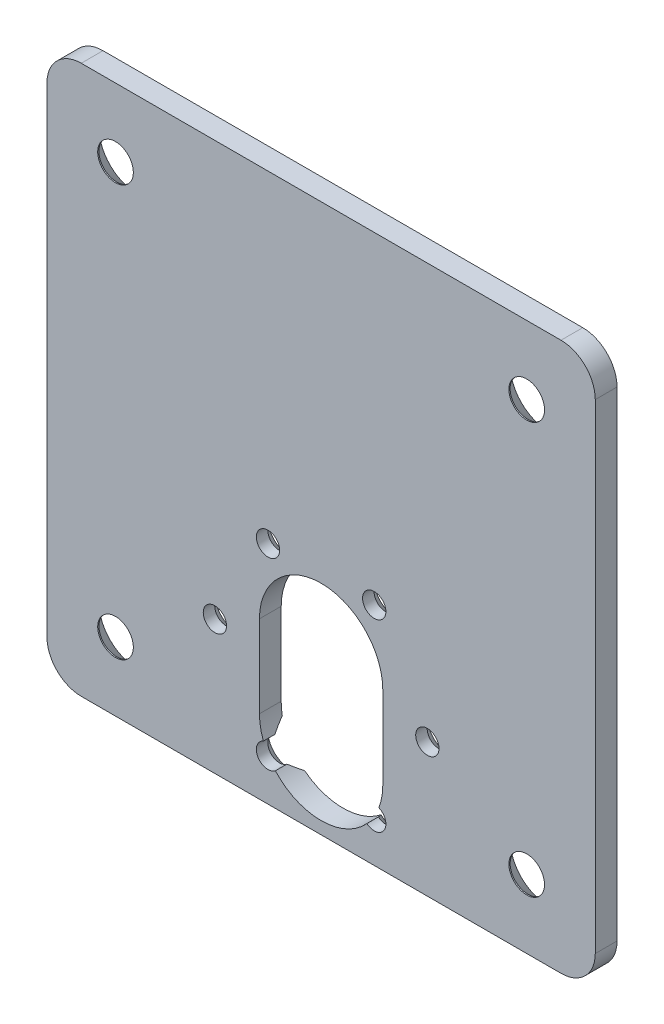
ISO-10303-21;
HEADER;
FILE_DESCRIPTION(('STEP AP214'),'2;1');
FILE_NAME('part.step','',(''),(''),'','','');
FILE_SCHEMA(('AUTOMOTIVE_DESIGN { 1 0 10303 214 1 1 1 1 }'));
ENDSEC;
DATA;
#1=APPLICATION_CONTEXT('core data for automotive mechanical design processes');
#2=APPLICATION_PROTOCOL_DEFINITION('international standard','automotive_design',2000,#1);
#3=PRODUCT_CONTEXT('',#1,'mechanical');
#4=PRODUCT('Part','Part','',(#3));
#5=PRODUCT_RELATED_PRODUCT_CATEGORY('part','',(#4));
#6=PRODUCT_DEFINITION_FORMATION('','',#4);
#7=PRODUCT_DEFINITION_CONTEXT('part definition',#1,'design');
#8=PRODUCT_DEFINITION('design','',#6,#7);
#9=PRODUCT_DEFINITION_SHAPE('','',#8);
#10=(LENGTH_UNIT() NAMED_UNIT(*) SI_UNIT(.MILLI.,.METRE.));
#11=(NAMED_UNIT(*) PLANE_ANGLE_UNIT() SI_UNIT($,.RADIAN.));
#12=(NAMED_UNIT(*) SI_UNIT($,.STERADIAN.) SOLID_ANGLE_UNIT());
#13=UNCERTAINTY_MEASURE_WITH_UNIT(LENGTH_MEASURE(1.E-05),#10,'distance_accuracy_value','');
#14=(GEOMETRIC_REPRESENTATION_CONTEXT(3) GLOBAL_UNCERTAINTY_ASSIGNED_CONTEXT((#13)) GLOBAL_UNIT_ASSIGNED_CONTEXT((#10,
#11,#12)) REPRESENTATION_CONTEXT('',''));
#15=CARTESIAN_POINT('',(0.,0.,0.));
#16=DIRECTION('',(0.,0.,1.));
#17=DIRECTION('',(1.,0.,0.));
#18=AXIS2_PLACEMENT_3D('',#15,#16,#17);
#19=CARTESIAN_POINT('',(-35.,-35.,3.175));
#20=DIRECTION('',(0.,0.,1.));
#21=DIRECTION('',(1.,0.,0.));
#22=AXIS2_PLACEMENT_3D('',#19,#20,#21);
#23=PLANE('',#22);
#24=CARTESIAN_POINT('',(-7.74999999999989,-7.0766062413412,3.175));
#25=DIRECTION('',(0.,0.,-1.));
#26=DIRECTION('',(-1.,0.,0.));
#27=AXIS2_PLACEMENT_3D('',#24,#25,#26);
#28=CIRCLE('',#27,1.7);
#29=CARTESIAN_POINT('',(-9.44999999999989,-7.0766062413412,3.175));
#30=VERTEX_POINT('',#29);
#31=EDGE_CURVE('E200',#30,#30,#28,.T.);
#32=ORIENTED_EDGE('',*,*,#31,.T.);
#33=EDGE_LOOP('',(#32));
#34=FACE_BOUND('',#33,.T.);
#35=CARTESIAN_POINT('',(-2.45029690981724E-11,-29.2025599760143,3.175));
#36=DIRECTION('',(0.,0.,-1.));
#37=DIRECTION('',(-1.,0.,0.));
#38=AXIS2_PLACEMENT_3D('',#35,#36,#37);
#39=CIRCLE('',#38,9.);
#40=CARTESIAN_POINT('',(-8.42653520092069,-32.3638104418992,3.175));
#41=VERTEX_POINT('',#40);
#42=CARTESIAN_POINT('',(-9.0000000000245,-29.2025599760143,3.175));
#43=VERTEX_POINT('',#42);
#44=EDGE_CURVE('E173',#41,#43,#39,.T.);
#45=ORIENTED_EDGE('',*,*,#44,.T.);
#46=DIRECTION('',(0.,1.,0.));
#47=VECTOR('',#46,1.);
#48=CARTESIAN_POINT('',(-9.0000000000245,-17.2025599760143,3.175));
#49=LINE('',#48,#47);
#50=CARTESIAN_POINT('',(-9.0000000000245,-17.2025599760143,3.175));
#51=VERTEX_POINT('',#50);
#52=EDGE_CURVE('E185',#43,#51,#49,.T.);
#53=ORIENTED_EDGE('',*,*,#52,.T.);
#54=CARTESIAN_POINT('',(0.,-17.2025599760143,3.175));
#55=DIRECTION('',(0.,0.,-1.));
#56=DIRECTION('',(-1.,0.,0.));
#57=AXIS2_PLACEMENT_3D('',#54,#55,#56);
#58=CIRCLE('',#57,9.);
#59=CARTESIAN_POINT('',(8.9999999999755,-17.2025599760143,3.175));
#60=VERTEX_POINT('',#59);
#61=EDGE_CURVE('E189',#51,#60,#58,.T.);
#62=ORIENTED_EDGE('',*,*,#61,.T.);
#63=DIRECTION('',(0.,-1.,0.));
#64=VECTOR('',#63,1.);
#65=CARTESIAN_POINT('',(8.9999999999755,-17.2025599760143,3.175));
#66=LINE('',#65,#64);
#67=CARTESIAN_POINT('',(8.9999999999755,-29.2025599760143,3.175));
#68=VERTEX_POINT('',#67);
#69=EDGE_CURVE('E203',#60,#68,#66,.T.);
#70=ORIENTED_EDGE('',*,*,#69,.T.);
#71=CARTESIAN_POINT('',(-2.45029690981724E-11,-29.2025599760143,3.175));
#72=DIRECTION('',(0.,0.,-1.));
#73=DIRECTION('',(-1.,0.,0.));
#74=AXIS2_PLACEMENT_3D('',#71,#72,#73);
#75=CIRCLE('',#74,9.);
#76=CARTESIAN_POINT('',(8.4265352008785,-32.363810441881,3.175));
#77=VERTEX_POINT('',#76);
#78=EDGE_CURVE('E206',#68,#77,#75,.T.);
#79=ORIENTED_EDGE('',*,*,#78,.T.);
#80=CARTESIAN_POINT('',(7.74999999999987,-33.923393758659,3.175));
#81=DIRECTION('',(0.,0.,-1.));
#82=DIRECTION('',(-1.,0.,0.));
#83=AXIS2_PLACEMENT_3D('',#80,#81,#82);
#84=CIRCLE('',#83,1.7);
#85=CARTESIAN_POINT('',(6.67454591679545,-35.2399796901192,3.175));
#86=VERTEX_POINT('',#85);
#87=EDGE_CURVE('E209',#77,#86,#84,.T.);
#88=ORIENTED_EDGE('',*,*,#87,.T.);
#89=CARTESIAN_POINT('',(-2.45029690981724E-11,-29.2025599760143,3.175));
#90=DIRECTION('',(0.,0.,-1.));
#91=DIRECTION('',(-1.,0.,0.));
#92=AXIS2_PLACEMENT_3D('',#89,#90,#91);
#93=CIRCLE('',#92,9.);
#94=CARTESIAN_POINT('',(-6.67454591682371,-35.2399796901421,3.175));
#95=VERTEX_POINT('',#94);
#96=EDGE_CURVE('E212',#86,#95,#93,.T.);
#97=ORIENTED_EDGE('',*,*,#96,.T.);
#98=CARTESIAN_POINT('',(-7.74999999999998,-33.9233937586589,3.175));
#99=DIRECTION('',(0.,0.,-1.));
#100=DIRECTION('',(-1.,0.,0.));
#101=AXIS2_PLACEMENT_3D('',#98,#99,#100);
#102=CIRCLE('',#101,1.7);
#103=EDGE_CURVE('E181',#95,#41,#102,.T.);
#104=ORIENTED_EDGE('',*,*,#103,.T.);
#105=EDGE_LOOP('',(#45,#53,#62,#70,#79,#88,#97,#104));
#106=FACE_BOUND('',#105,.T.);
#107=CARTESIAN_POINT('',(-15.5,-20.5000000000001,3.175));
#108=DIRECTION('',(0.,0.,-1.));
#109=DIRECTION('',(-1.,0.,0.));
#110=AXIS2_PLACEMENT_3D('',#107,#108,#109);
#111=CIRCLE('',#110,1.69999999999999);
#112=CARTESIAN_POINT('',(-17.2,-20.5000000000001,3.175));
#113=VERTEX_POINT('',#112);
#114=EDGE_CURVE('E228',#113,#113,#111,.T.);
#115=ORIENTED_EDGE('',*,*,#114,.T.);
#116=EDGE_LOOP('',(#115));
#117=FACE_BOUND('',#116,.T.);
#118=CARTESIAN_POINT('',(7.75000000000005,-7.0766062413413,3.175));
#119=DIRECTION('',(0.,0.,-1.));
#120=DIRECTION('',(-1.,0.,0.));
#121=AXIS2_PLACEMENT_3D('',#118,#119,#120);
#122=CIRCLE('',#121,1.7);
#123=CARTESIAN_POINT('',(6.05000000000005,-7.0766062413413,3.175));
#124=VERTEX_POINT('',#123);
#125=EDGE_CURVE('E245',#124,#124,#122,.T.);
#126=ORIENTED_EDGE('',*,*,#125,.T.);
#127=EDGE_LOOP('',(#126));
#128=FACE_BOUND('',#127,.T.);
#129=CARTESIAN_POINT('',(15.5,-20.5000000000002,3.175));
#130=DIRECTION('',(0.,0.,-1.));
#131=DIRECTION('',(-1.,0.,0.));
#132=AXIS2_PLACEMENT_3D('',#129,#130,#131);
#133=CIRCLE('',#132,1.7);
#134=CARTESIAN_POINT('',(13.8,-20.5000000000002,3.175));
#135=VERTEX_POINT('',#134);
#136=EDGE_CURVE('E248',#135,#135,#133,.T.);
#137=ORIENTED_EDGE('',*,*,#136,.T.);
#138=EDGE_LOOP('',(#137));
#139=FACE_BOUND('',#138,.T.);
#140=CARTESIAN_POINT('',(30.,-30.,3.175));
#141=DIRECTION('',(0.,0.,1.));
#142=DIRECTION('',(1.,0.,0.));
#143=AXIS2_PLACEMENT_3D('',#140,#141,#142);
#144=CIRCLE('',#143,2.59999999999999);
#145=CARTESIAN_POINT('',(32.6,-30.,3.175));
#146=VERTEX_POINT('',#145);
#147=EDGE_CURVE('E254',#146,#146,#144,.T.);
#148=ORIENTED_EDGE('',*,*,#147,.F.);
#149=EDGE_LOOP('',(#148));
#150=FACE_BOUND('',#149,.T.);
#151=CARTESIAN_POINT('',(-30.,30.,3.175));
#152=DIRECTION('',(0.,0.,1.));
#153=DIRECTION('',(1.,0.,0.));
#154=AXIS2_PLACEMENT_3D('',#151,#152,#153);
#155=CIRCLE('',#154,2.6);
#156=CARTESIAN_POINT('',(-27.4,30.,3.175));
#157=VERTEX_POINT('',#156);
#158=EDGE_CURVE('E260',#157,#157,#155,.T.);
#159=ORIENTED_EDGE('',*,*,#158,.F.);
#160=EDGE_LOOP('',(#159));
#161=FACE_BOUND('',#160,.T.);
#162=CARTESIAN_POINT('',(-35.,-35.,3.175));
#163=DIRECTION('',(0.,0.,1.));
#164=DIRECTION('',(1.,0.,0.));
#165=AXIS2_PLACEMENT_3D('',#162,#163,#164);
#166=CIRCLE('',#165,5.00000000000001);
#167=CARTESIAN_POINT('',(-40.,-35.,3.175));
#168=VERTEX_POINT('',#167);
#169=CARTESIAN_POINT('',(-35.,-40.,3.175));
#170=VERTEX_POINT('',#169);
#171=EDGE_CURVE('E264',#168,#170,#166,.T.);
#172=ORIENTED_EDGE('',*,*,#171,.T.);
#173=DIRECTION('',(1.,0.,0.));
#174=VECTOR('',#173,1.);
#175=CARTESIAN_POINT('',(35.,-40.,3.175));
#176=LINE('',#175,#174);
#177=CARTESIAN_POINT('',(35.,-40.,3.175));
#178=VERTEX_POINT('',#177);
#179=EDGE_CURVE('E267',#170,#178,#176,.T.);
#180=ORIENTED_EDGE('',*,*,#179,.T.);
#181=CARTESIAN_POINT('',(35.,-35.,3.175));
#182=DIRECTION('',(0.,0.,1.));
#183=DIRECTION('',(1.,0.,0.));
#184=AXIS2_PLACEMENT_3D('',#181,#182,#183);
#185=CIRCLE('',#184,4.99999999999999);
#186=CARTESIAN_POINT('',(40.,-35.,3.175));
#187=VERTEX_POINT('',#186);
#188=EDGE_CURVE('E271',#178,#187,#185,.T.);
#189=ORIENTED_EDGE('',*,*,#188,.T.);
#190=DIRECTION('',(0.,1.,0.));
#191=VECTOR('',#190,1.);
#192=CARTESIAN_POINT('',(40.,-35.,3.175));
#193=LINE('',#192,#191);
#194=CARTESIAN_POINT('',(40.,35.,3.175));
#195=VERTEX_POINT('',#194);
#196=EDGE_CURVE('E273',#187,#195,#193,.T.);
#197=ORIENTED_EDGE('',*,*,#196,.T.);
#198=CARTESIAN_POINT('',(35.,35.,3.175));
#199=DIRECTION('',(0.,0.,1.));
#200=DIRECTION('',(1.,0.,0.));
#201=AXIS2_PLACEMENT_3D('',#198,#199,#200);
#202=CIRCLE('',#201,5.);
#203=CARTESIAN_POINT('',(35.,40.,3.175));
#204=VERTEX_POINT('',#203);
#205=EDGE_CURVE('E275',#195,#204,#202,.T.);
#206=ORIENTED_EDGE('',*,*,#205,.T.);
#207=DIRECTION('',(-1.,0.,0.));
#208=VECTOR('',#207,1.);
#209=CARTESIAN_POINT('',(35.,40.,3.175));
#210=LINE('',#209,#208);
#211=CARTESIAN_POINT('',(-35.,40.,3.175));
#212=VERTEX_POINT('',#211);
#213=EDGE_CURVE('E277',#204,#212,#210,.T.);
#214=ORIENTED_EDGE('',*,*,#213,.T.);
#215=CARTESIAN_POINT('',(-35.,35.,3.175));
#216=DIRECTION('',(0.,0.,1.));
#217=DIRECTION('',(1.,0.,0.));
#218=AXIS2_PLACEMENT_3D('',#215,#216,#217);
#219=CIRCLE('',#218,5.);
#220=CARTESIAN_POINT('',(-40.,35.,3.175));
#221=VERTEX_POINT('',#220);
#222=EDGE_CURVE('E279',#212,#221,#219,.T.);
#223=ORIENTED_EDGE('',*,*,#222,.T.);
#224=DIRECTION('',(0.,-1.,0.));
#225=VECTOR('',#224,1.);
#226=CARTESIAN_POINT('',(-40.,-35.,3.175));
#227=LINE('',#226,#225);
#228=EDGE_CURVE('E281',#221,#168,#227,.T.);
#229=ORIENTED_EDGE('',*,*,#228,.T.);
#230=EDGE_LOOP('',(#172,#180,#189,#197,#206,#214,#223,#229));
#231=FACE_BOUND('',#230,.T.);
#232=CARTESIAN_POINT('',(30.,30.,3.175));
#233=DIRECTION('',(0.,0.,1.));
#234=DIRECTION('',(-1.,0.,0.));
#235=AXIS2_PLACEMENT_3D('',#232,#233,#234);
#236=CIRCLE('',#235,2.59999999999999);
#237=CARTESIAN_POINT('',(27.4,30.,3.175));
#238=VERTEX_POINT('',#237);
#239=EDGE_CURVE('E257',#238,#238,#236,.T.);
#240=ORIENTED_EDGE('',*,*,#239,.F.);
#241=EDGE_LOOP('',(#240));
#242=FACE_BOUND('',#241,.T.);
#243=CARTESIAN_POINT('',(-30.,-30.,3.175));
#244=DIRECTION('',(0.,0.,1.));
#245=DIRECTION('',(-1.,0.,0.));
#246=AXIS2_PLACEMENT_3D('',#243,#244,#245);
#247=CIRCLE('',#246,2.6);
#248=CARTESIAN_POINT('',(-32.6,-30.,3.175));
#249=VERTEX_POINT('',#248);
#250=EDGE_CURVE('E251',#249,#249,#247,.T.);
#251=ORIENTED_EDGE('',*,*,#250,.F.);
#252=EDGE_LOOP('',(#251));
#253=FACE_BOUND('',#252,.T.);
#254=ADVANCED_FACE('F39',(#34,#106,#117,#128,#139,#150,#161,#231,#242,#253),#23,.T.);
#255=CARTESIAN_POINT('',(-35.,-35.,0.));
#256=DIRECTION('',(0.,0.,1.));
#257=DIRECTION('',(1.,0.,0.));
#258=AXIS2_PLACEMENT_3D('',#255,#256,#257);
#259=PLANE('',#258);
#260=CARTESIAN_POINT('',(-7.74999999999989,-7.0766062413412,0.));
#261=DIRECTION('',(0.,0.,1.));
#262=DIRECTION('',(1.,0.,0.));
#263=AXIS2_PLACEMENT_3D('',#260,#261,#262);
#264=CIRCLE('',#263,3.19999999999999);
#265=CARTESIAN_POINT('',(-4.5499999999999,-7.0766062413412,0.));
#266=VERTEX_POINT('',#265);
#267=EDGE_CURVE('E364',#266,#266,#264,.T.);
#268=ORIENTED_EDGE('',*,*,#267,.T.);
#269=EDGE_LOOP('',(#268));
#270=FACE_BOUND('',#269,.T.);
#271=CARTESIAN_POINT('',(7.75000000000005,-7.0766062413413,0.));
#272=DIRECTION('',(0.,0.,1.));
#273=DIRECTION('',(1.,0.,0.));
#274=AXIS2_PLACEMENT_3D('',#271,#272,#273);
#275=CIRCLE('',#274,3.19999999999999);
#276=CARTESIAN_POINT('',(10.95,-7.0766062413413,0.));
#277=VERTEX_POINT('',#276);
#278=EDGE_CURVE('E361',#277,#277,#275,.T.);
#279=ORIENTED_EDGE('',*,*,#278,.T.);
#280=EDGE_LOOP('',(#279));
#281=FACE_BOUND('',#280,.T.);
#282=CARTESIAN_POINT('',(-15.5,-20.5000000000001,0.));
#283=DIRECTION('',(0.,0.,1.));
#284=DIRECTION('',(1.,0.,0.));
#285=AXIS2_PLACEMENT_3D('',#282,#283,#284);
#286=CIRCLE('',#285,3.19999999999998);
#287=CARTESIAN_POINT('',(-12.3,-20.5000000000001,0.));
#288=VERTEX_POINT('',#287);
#289=EDGE_CURVE('E353',#288,#288,#286,.T.);
#290=ORIENTED_EDGE('',*,*,#289,.T.);
#291=EDGE_LOOP('',(#290));
#292=FACE_BOUND('',#291,.T.);
#293=CARTESIAN_POINT('',(15.5,-20.5000000000002,0.));
#294=DIRECTION('',(0.,0.,1.));
#295=DIRECTION('',(1.,0.,0.));
#296=AXIS2_PLACEMENT_3D('',#293,#294,#295);
#297=CIRCLE('',#296,3.2);
#298=CARTESIAN_POINT('',(18.7,-20.5000000000002,0.));
#299=VERTEX_POINT('',#298);
#300=EDGE_CURVE('E350',#299,#299,#297,.T.);
#301=ORIENTED_EDGE('',*,*,#300,.T.);
#302=EDGE_LOOP('',(#301));
#303=FACE_BOUND('',#302,.T.);
#304=CARTESIAN_POINT('',(-2.45029690981724E-11,-29.2025599760143,0.));
#305=DIRECTION('',(0.,0.,-1.));
#306=DIRECTION('',(-1.,0.,0.));
#307=AXIS2_PLACEMENT_3D('',#304,#305,#306);
#308=CIRCLE('',#307,9.);
#309=CARTESIAN_POINT('',(5.57344120167671,-36.2691541465592,0.));
#310=VERTEX_POINT('',#309);
#311=CARTESIAN_POINT('',(-5.57344120169929,-36.26915414658,0.));
#312=VERTEX_POINT('',#311);
#313=EDGE_CURVE('E194',#310,#312,#308,.T.);
#314=ORIENTED_EDGE('',*,*,#313,.F.);
#315=CARTESIAN_POINT('',(7.74999999999987,-33.923393758659,0.));
#316=DIRECTION('',(0.,0.,1.));
#317=DIRECTION('',(1.,0.,0.));
#318=AXIS2_PLACEMENT_3D('',#315,#316,#317);
#319=CIRCLE('',#318,3.19999999999999);
#320=CARTESIAN_POINT('',(8.83591739371989,-30.9132802368767,0.));
#321=VERTEX_POINT('',#320);
#322=EDGE_CURVE('E358',#310,#321,#319,.T.);
#323=ORIENTED_EDGE('',*,*,#322,.T.);
#324=CARTESIAN_POINT('',(-2.45029690981724E-11,-29.2025599760143,0.));
#325=DIRECTION('',(0.,0.,-1.));
#326=DIRECTION('',(-1.,0.,0.));
#327=AXIS2_PLACEMENT_3D('',#324,#325,#326);
#328=CIRCLE('',#327,9.);
#329=CARTESIAN_POINT('',(8.9999999999755,-29.2025599760143,0.));
#330=VERTEX_POINT('',#329);
#331=EDGE_CURVE('E197',#330,#321,#328,.T.);
#332=ORIENTED_EDGE('',*,*,#331,.F.);
#333=DIRECTION('',(0.,-1.,0.));
#334=VECTOR('',#333,1.);
#335=CARTESIAN_POINT('',(8.9999999999755,-17.2025599760143,0.));
#336=LINE('',#335,#334);
#337=CARTESIAN_POINT('',(8.9999999999755,-17.2025599760143,0.));
#338=VERTEX_POINT('',#337);
#339=EDGE_CURVE('E221',#338,#330,#336,.T.);
#340=ORIENTED_EDGE('',*,*,#339,.F.);
#341=CARTESIAN_POINT('',(0.,-17.2025599760143,0.));
#342=DIRECTION('',(0.,0.,-1.));
#343=DIRECTION('',(-1.,0.,0.));
#344=AXIS2_PLACEMENT_3D('',#341,#342,#343);
#345=CIRCLE('',#344,9.);
#346=CARTESIAN_POINT('',(-8.99999999999999,-17.2025599760143,0.));
#347=VERTEX_POINT('',#346);
#348=EDGE_CURVE('E218',#347,#338,#345,.T.);
#349=ORIENTED_EDGE('',*,*,#348,.F.);
#350=DIRECTION('',(0.,1.,0.));
#351=VECTOR('',#350,1.);
#352=CARTESIAN_POINT('',(-9.0000000000245,-17.2025599760143,0.));
#353=LINE('',#352,#351);
#354=CARTESIAN_POINT('',(-9.0000000000245,-29.2025599760143,0.));
#355=VERTEX_POINT('',#354);
#356=EDGE_CURVE('E216',#355,#347,#353,.T.);
#357=ORIENTED_EDGE('',*,*,#356,.F.);
#358=CARTESIAN_POINT('',(-2.45029690981724E-11,-29.2025599760143,0.));
#359=DIRECTION('',(0.,0.,-1.));
#360=DIRECTION('',(-1.,0.,0.));
#361=AXIS2_PLACEMENT_3D('',#358,#359,#360);
#362=CIRCLE('',#361,9.);
#363=CARTESIAN_POINT('',(-8.83591739376573,-30.9132802368931,0.));
#364=VERTEX_POINT('',#363);
#365=EDGE_CURVE('E176',#364,#355,#362,.T.);
#366=ORIENTED_EDGE('',*,*,#365,.F.);
#367=CARTESIAN_POINT('',(-7.74999999999998,-33.9233937586589,0.));
#368=DIRECTION('',(0.,0.,1.));
#369=DIRECTION('',(1.,0.,0.));
#370=AXIS2_PLACEMENT_3D('',#367,#368,#369);
#371=CIRCLE('',#370,3.20000000000002);
#372=EDGE_CURVE('E356',#364,#312,#371,.T.);
#373=ORIENTED_EDGE('',*,*,#372,.T.);
#374=EDGE_LOOP('',(#314,#323,#332,#340,#349,#357,#366,#373));
#375=FACE_BOUND('',#374,.T.);
#376=CARTESIAN_POINT('',(30.,30.,0.));
#377=DIRECTION('',(0.,0.,1.));
#378=DIRECTION('',(1.,0.,0.));
#379=AXIS2_PLACEMENT_3D('',#376,#377,#378);
#380=CIRCLE('',#379,5.59999999999998);
#381=CARTESIAN_POINT('',(35.6,30.,0.));
#382=VERTEX_POINT('',#381);
#383=EDGE_CURVE('E332',#382,#382,#380,.T.);
#384=ORIENTED_EDGE('',*,*,#383,.T.);
#385=EDGE_LOOP('',(#384));
#386=FACE_BOUND('',#385,.T.);
#387=CARTESIAN_POINT('',(-30.,30.,0.));
#388=DIRECTION('',(0.,0.,1.));
#389=DIRECTION('',(1.,0.,0.));
#390=AXIS2_PLACEMENT_3D('',#387,#388,#389);
#391=CIRCLE('',#390,5.59999999999998);
#392=CARTESIAN_POINT('',(-24.4,30.,0.));
#393=VERTEX_POINT('',#392);
#394=EDGE_CURVE('E329',#393,#393,#391,.T.);
#395=ORIENTED_EDGE('',*,*,#394,.T.);
#396=EDGE_LOOP('',(#395));
#397=FACE_BOUND('',#396,.T.);
#398=CARTESIAN_POINT('',(30.,-30.,0.));
#399=DIRECTION('',(0.,0.,1.));
#400=DIRECTION('',(1.,0.,0.));
#401=AXIS2_PLACEMENT_3D('',#398,#399,#400);
#402=CIRCLE('',#401,5.60000000000002);
#403=CARTESIAN_POINT('',(35.6,-30.,0.));
#404=VERTEX_POINT('',#403);
#405=EDGE_CURVE('E326',#404,#404,#402,.T.);
#406=ORIENTED_EDGE('',*,*,#405,.T.);
#407=EDGE_LOOP('',(#406));
#408=FACE_BOUND('',#407,.T.);
#409=CARTESIAN_POINT('',(-30.,-30.,0.));
#410=DIRECTION('',(0.,0.,1.));
#411=DIRECTION('',(1.,0.,0.));
#412=AXIS2_PLACEMENT_3D('',#409,#410,#411);
#413=CIRCLE('',#412,5.60000000000002);
#414=CARTESIAN_POINT('',(-24.4,-30.,0.));
#415=VERTEX_POINT('',#414);
#416=EDGE_CURVE('E323',#415,#415,#413,.T.);
#417=ORIENTED_EDGE('',*,*,#416,.T.);
#418=EDGE_LOOP('',(#417));
#419=FACE_BOUND('',#418,.T.);
#420=CARTESIAN_POINT('',(-35.,-35.,0.));
#421=DIRECTION('',(0.,0.,1.));
#422=DIRECTION('',(1.,0.,0.));
#423=AXIS2_PLACEMENT_3D('',#420,#421,#422);
#424=CIRCLE('',#423,5.00000000000001);
#425=CARTESIAN_POINT('',(-40.,-35.,0.));
#426=VERTEX_POINT('',#425);
#427=CARTESIAN_POINT('',(-35.,-40.,0.));
#428=VERTEX_POINT('',#427);
#429=EDGE_CURVE('E263',#426,#428,#424,.T.);
#430=ORIENTED_EDGE('',*,*,#429,.F.);
#431=DIRECTION('',(0.,-1.,0.));
#432=VECTOR('',#431,1.);
#433=CARTESIAN_POINT('',(-40.,-35.,0.));
#434=LINE('',#433,#432);
#435=CARTESIAN_POINT('',(-40.,35.,0.));
#436=VERTEX_POINT('',#435);
#437=EDGE_CURVE('E268',#436,#426,#434,.T.);
#438=ORIENTED_EDGE('',*,*,#437,.F.);
#439=CARTESIAN_POINT('',(-35.,35.,0.));
#440=DIRECTION('',(0.,0.,1.));
#441=DIRECTION('',(1.,0.,0.));
#442=AXIS2_PLACEMENT_3D('',#439,#440,#441);
#443=CIRCLE('',#442,5.);
#444=CARTESIAN_POINT('',(-35.,40.,0.));
#445=VERTEX_POINT('',#444);
#446=EDGE_CURVE('E297',#445,#436,#443,.T.);
#447=ORIENTED_EDGE('',*,*,#446,.F.);
#448=DIRECTION('',(-1.,0.,0.));
#449=VECTOR('',#448,1.);
#450=CARTESIAN_POINT('',(35.,40.,0.));
#451=LINE('',#450,#449);
#452=CARTESIAN_POINT('',(35.,40.,0.));
#453=VERTEX_POINT('',#452);
#454=EDGE_CURVE('E295',#453,#445,#451,.T.);
#455=ORIENTED_EDGE('',*,*,#454,.F.);
#456=CARTESIAN_POINT('',(35.,35.,0.));
#457=DIRECTION('',(0.,0.,1.));
#458=DIRECTION('',(1.,0.,0.));
#459=AXIS2_PLACEMENT_3D('',#456,#457,#458);
#460=CIRCLE('',#459,5.);
#461=CARTESIAN_POINT('',(40.,35.,0.));
#462=VERTEX_POINT('',#461);
#463=EDGE_CURVE('E293',#462,#453,#460,.T.);
#464=ORIENTED_EDGE('',*,*,#463,.F.);
#465=DIRECTION('',(0.,1.,0.));
#466=VECTOR('',#465,1.);
#467=CARTESIAN_POINT('',(40.,-35.,0.));
#468=LINE('',#467,#466);
#469=CARTESIAN_POINT('',(40.,-35.,0.));
#470=VERTEX_POINT('',#469);
#471=EDGE_CURVE('E291',#470,#462,#468,.T.);
#472=ORIENTED_EDGE('',*,*,#471,.F.);
#473=CARTESIAN_POINT('',(35.,-35.,0.));
#474=DIRECTION('',(0.,0.,1.));
#475=DIRECTION('',(1.,0.,0.));
#476=AXIS2_PLACEMENT_3D('',#473,#474,#475);
#477=CIRCLE('',#476,4.99999999999999);
#478=CARTESIAN_POINT('',(35.,-40.,0.));
#479=VERTEX_POINT('',#478);
#480=EDGE_CURVE('E289',#479,#470,#477,.T.);
#481=ORIENTED_EDGE('',*,*,#480,.F.);
#482=DIRECTION('',(1.,0.,0.));
#483=VECTOR('',#482,1.);
#484=CARTESIAN_POINT('',(35.,-40.,0.));
#485=LINE('',#484,#483);
#486=EDGE_CURVE('E286',#428,#479,#485,.T.);
#487=ORIENTED_EDGE('',*,*,#486,.F.);
#488=EDGE_LOOP('',(#430,#438,#447,#455,#464,#472,#481,#487));
#489=FACE_BOUND('',#488,.T.);
#490=ADVANCED_FACE('F451',(#270,#281,#292,#303,#375,#386,#397,#408,#419,#489),#259,.F.);
#491=CARTESIAN_POINT('',(-35.,-35.,3.175));
#492=DIRECTION('',(0.,0.,-1.));
#493=DIRECTION('',(-1.,0.,0.));
#494=AXIS2_PLACEMENT_3D('',#491,#492,#493);
#495=CYLINDRICAL_SURFACE('',#494,5.00000000000001);
#496=ORIENTED_EDGE('',*,*,#429,.T.);
#497=DIRECTION('',(0.,0.,-1.));
#498=VECTOR('',#497,1.);
#499=CARTESIAN_POINT('',(-35.,-40.,3.175));
#500=LINE('',#499,#498);
#501=EDGE_CURVE('E320',#170,#428,#500,.T.);
#502=ORIENTED_EDGE('',*,*,#501,.F.);
#503=ORIENTED_EDGE('',*,*,#171,.F.);
#504=DIRECTION('',(0.,0.,-1.));
#505=VECTOR('',#504,1.);
#506=CARTESIAN_POINT('',(-40.,-35.,3.175));
#507=LINE('',#506,#505);
#508=EDGE_CURVE('E283',#168,#426,#507,.T.);
#509=ORIENTED_EDGE('',*,*,#508,.T.);
#510=EDGE_LOOP('',(#496,#502,#503,#509));
#511=FACE_BOUND('',#510,.T.);
#512=ADVANCED_FACE('F447',(#511),#495,.T.);
#513=CARTESIAN_POINT('',(35.,-40.,3.175));
#514=DIRECTION('',(0.,1.,0.));
#515=DIRECTION('',(-1.,0.,0.));
#516=AXIS2_PLACEMENT_3D('',#513,#514,#515);
#517=PLANE('',#516);
#518=ORIENTED_EDGE('',*,*,#486,.T.);
#519=DIRECTION('',(0.,0.,-1.));
#520=VECTOR('',#519,1.);
#521=CARTESIAN_POINT('',(35.,-40.,3.175));
#522=LINE('',#521,#520);
#523=EDGE_CURVE('E317',#178,#479,#522,.T.);
#524=ORIENTED_EDGE('',*,*,#523,.F.);
#525=ORIENTED_EDGE('',*,*,#179,.F.);
#526=ORIENTED_EDGE('',*,*,#501,.T.);
#527=EDGE_LOOP('',(#518,#524,#525,#526));
#528=FACE_BOUND('',#527,.T.);
#529=ADVANCED_FACE('F450',(#528),#517,.F.);
#530=CARTESIAN_POINT('',(35.,-35.,3.175));
#531=DIRECTION('',(0.,0.,-1.));
#532=DIRECTION('',(-1.,0.,0.));
#533=AXIS2_PLACEMENT_3D('',#530,#531,#532);
#534=CYLINDRICAL_SURFACE('',#533,4.99999999999999);
#535=ORIENTED_EDGE('',*,*,#480,.T.);
#536=DIRECTION('',(0.,0.,-1.));
#537=VECTOR('',#536,1.);
#538=CARTESIAN_POINT('',(40.,-35.,3.175));
#539=LINE('',#538,#537);
#540=EDGE_CURVE('E314',#187,#470,#539,.T.);
#541=ORIENTED_EDGE('',*,*,#540,.F.);
#542=ORIENTED_EDGE('',*,*,#188,.F.);
#543=ORIENTED_EDGE('',*,*,#523,.T.);
#544=EDGE_LOOP('',(#535,#541,#542,#543));
#545=FACE_BOUND('',#544,.T.);
#546=ADVANCED_FACE('F455',(#545),#534,.T.);
#547=CARTESIAN_POINT('',(40.,-35.,3.175));
#548=DIRECTION('',(-1.,0.,0.));
#549=DIRECTION('',(0.,-1.,0.));
#550=AXIS2_PLACEMENT_3D('',#547,#548,#549);
#551=PLANE('',#550);
#552=ORIENTED_EDGE('',*,*,#471,.T.);
#553=DIRECTION('',(0.,0.,-1.));
#554=VECTOR('',#553,1.);
#555=CARTESIAN_POINT('',(40.,35.,3.175));
#556=LINE('',#555,#554);
#557=EDGE_CURVE('E311',#195,#462,#556,.T.);
#558=ORIENTED_EDGE('',*,*,#557,.F.);
#559=ORIENTED_EDGE('',*,*,#196,.F.);
#560=ORIENTED_EDGE('',*,*,#540,.T.);
#561=EDGE_LOOP('',(#552,#558,#559,#560));
#562=FACE_BOUND('',#561,.T.);
#563=ADVANCED_FACE('F459',(#562),#551,.F.);
#564=CARTESIAN_POINT('',(35.,35.,3.175));
#565=DIRECTION('',(0.,0.,-1.));
#566=DIRECTION('',(-1.,0.,0.));
#567=AXIS2_PLACEMENT_3D('',#564,#565,#566);
#568=CYLINDRICAL_SURFACE('',#567,5.);
#569=ORIENTED_EDGE('',*,*,#463,.T.);
#570=DIRECTION('',(0.,0.,-1.));
#571=VECTOR('',#570,1.);
#572=CARTESIAN_POINT('',(35.,40.,3.175));
#573=LINE('',#572,#571);
#574=EDGE_CURVE('E308',#204,#453,#573,.T.);
#575=ORIENTED_EDGE('',*,*,#574,.F.);
#576=ORIENTED_EDGE('',*,*,#205,.F.);
#577=ORIENTED_EDGE('',*,*,#557,.T.);
#578=EDGE_LOOP('',(#569,#575,#576,#577));
#579=FACE_BOUND('',#578,.T.);
#580=ADVANCED_FACE('F463',(#579),#568,.T.);
#581=CARTESIAN_POINT('',(35.,40.,3.175));
#582=DIRECTION('',(0.,-1.,0.));
#583=DIRECTION('',(1.,0.,0.));
#584=AXIS2_PLACEMENT_3D('',#581,#582,#583);
#585=PLANE('',#584);
#586=ORIENTED_EDGE('',*,*,#454,.T.);
#587=DIRECTION('',(0.,0.,-1.));
#588=VECTOR('',#587,1.);
#589=CARTESIAN_POINT('',(-35.,40.,3.175));
#590=LINE('',#589,#588);
#591=EDGE_CURVE('E305',#212,#445,#590,.T.);
#592=ORIENTED_EDGE('',*,*,#591,.F.);
#593=ORIENTED_EDGE('',*,*,#213,.F.);
#594=ORIENTED_EDGE('',*,*,#574,.T.);
#595=EDGE_LOOP('',(#586,#592,#593,#594));
#596=FACE_BOUND('',#595,.T.);
#597=ADVANCED_FACE('F467',(#596),#585,.F.);
#598=CARTESIAN_POINT('',(-35.,35.,3.175));
#599=DIRECTION('',(0.,0.,-1.));
#600=DIRECTION('',(-1.,0.,0.));
#601=AXIS2_PLACEMENT_3D('',#598,#599,#600);
#602=CYLINDRICAL_SURFACE('',#601,5.);
#603=ORIENTED_EDGE('',*,*,#446,.T.);
#604=DIRECTION('',(0.,0.,-1.));
#605=VECTOR('',#604,1.);
#606=CARTESIAN_POINT('',(-40.,35.,3.175));
#607=LINE('',#606,#605);
#608=EDGE_CURVE('E302',#221,#436,#607,.T.);
#609=ORIENTED_EDGE('',*,*,#608,.F.);
#610=ORIENTED_EDGE('',*,*,#222,.F.);
#611=ORIENTED_EDGE('',*,*,#591,.T.);
#612=EDGE_LOOP('',(#603,#609,#610,#611));
#613=FACE_BOUND('',#612,.T.);
#614=ADVANCED_FACE('F471',(#613),#602,.T.);
#615=CARTESIAN_POINT('',(-40.,-35.,3.175));
#616=DIRECTION('',(1.,0.,0.));
#617=DIRECTION('',(0.,1.,0.));
#618=AXIS2_PLACEMENT_3D('',#615,#616,#617);
#619=PLANE('',#618);
#620=ORIENTED_EDGE('',*,*,#437,.T.);
#621=ORIENTED_EDGE('',*,*,#508,.F.);
#622=ORIENTED_EDGE('',*,*,#228,.F.);
#623=ORIENTED_EDGE('',*,*,#608,.T.);
#624=EDGE_LOOP('',(#620,#621,#622,#623));
#625=FACE_BOUND('',#624,.T.);
#626=ADVANCED_FACE('F475',(#625),#619,.F.);
#627=CARTESIAN_POINT('',(-30.,30.,3.175));
#628=DIRECTION('',(0.,0.,-1.));
#629=DIRECTION('',(-1.,0.,0.));
#630=AXIS2_PLACEMENT_3D('',#627,#628,#629);
#631=CYLINDRICAL_SURFACE('',#630,2.6);
#632=CARTESIAN_POINT('',(-30.,30.,3.));
#633=DIRECTION('',(0.,0.,1.));
#634=DIRECTION('',(1.,0.,0.));
#635=AXIS2_PLACEMENT_3D('',#632,#633,#634);
#636=CIRCLE('',#635,2.6);
#637=CARTESIAN_POINT('',(-27.4,30.,3.));
#638=VERTEX_POINT('',#637);
#639=EDGE_CURVE('E338',#638,#638,#636,.F.);
#640=ORIENTED_EDGE('',*,*,#639,.T.);
#641=EDGE_LOOP('',(#640));
#642=FACE_BOUND('',#641,.T.);
#643=ORIENTED_EDGE('',*,*,#158,.T.);
#644=EDGE_LOOP('',(#643));
#645=FACE_BOUND('',#644,.T.);
#646=ADVANCED_FACE('F479',(#642,#645),#631,.F.);
#647=CARTESIAN_POINT('',(30.,30.,3.175));
#648=DIRECTION('',(0.,0.,-1.));
#649=DIRECTION('',(-1.,0.,0.));
#650=AXIS2_PLACEMENT_3D('',#647,#648,#649);
#651=CYLINDRICAL_SURFACE('',#650,2.59999999999999);
#652=CARTESIAN_POINT('',(30.,30.,3.));
#653=DIRECTION('',(0.,0.,1.));
#654=DIRECTION('',(1.,0.,0.));
#655=AXIS2_PLACEMENT_3D('',#652,#653,#654);
#656=CIRCLE('',#655,2.59999999999999);
#657=CARTESIAN_POINT('',(32.6,30.,3.));
#658=VERTEX_POINT('',#657);
#659=EDGE_CURVE('E335',#658,#658,#656,.F.);
#660=ORIENTED_EDGE('',*,*,#659,.T.);
#661=EDGE_LOOP('',(#660));
#662=FACE_BOUND('',#661,.T.);
#663=ORIENTED_EDGE('',*,*,#239,.T.);
#664=EDGE_LOOP('',(#663));
#665=FACE_BOUND('',#664,.T.);
#666=ADVANCED_FACE('F489',(#662,#665),#651,.F.);
#667=CARTESIAN_POINT('',(30.,-30.,3.175));
#668=DIRECTION('',(0.,0.,-1.));
#669=DIRECTION('',(-1.,0.,0.));
#670=AXIS2_PLACEMENT_3D('',#667,#668,#669);
#671=CYLINDRICAL_SURFACE('',#670,2.59999999999999);
#672=CARTESIAN_POINT('',(30.,-30.,3.00000000000002));
#673=DIRECTION('',(0.,0.,1.));
#674=DIRECTION('',(1.,0.,0.));
#675=AXIS2_PLACEMENT_3D('',#672,#673,#674);
#676=CIRCLE('',#675,2.59999999999999);
#677=CARTESIAN_POINT('',(32.6,-30.,3.00000000000002));
#678=VERTEX_POINT('',#677);
#679=EDGE_CURVE('E341',#678,#678,#676,.F.);
#680=ORIENTED_EDGE('',*,*,#679,.T.);
#681=EDGE_LOOP('',(#680));
#682=FACE_BOUND('',#681,.T.);
#683=ORIENTED_EDGE('',*,*,#147,.T.);
#684=EDGE_LOOP('',(#683));
#685=FACE_BOUND('',#684,.T.);
#686=ADVANCED_FACE('F493',(#682,#685),#671,.F.);
#687=CARTESIAN_POINT('',(-30.,-30.,3.175));
#688=DIRECTION('',(0.,0.,-1.));
#689=DIRECTION('',(-1.,0.,0.));
#690=AXIS2_PLACEMENT_3D('',#687,#688,#689);
#691=CYLINDRICAL_SURFACE('',#690,2.6);
#692=CARTESIAN_POINT('',(-30.,-30.,3.00000000000002));
#693=DIRECTION('',(0.,0.,1.));
#694=DIRECTION('',(1.,0.,0.));
#695=AXIS2_PLACEMENT_3D('',#692,#693,#694);
#696=CIRCLE('',#695,2.6);
#697=CARTESIAN_POINT('',(-27.4,-30.,3.00000000000002));
#698=VERTEX_POINT('',#697);
#699=EDGE_CURVE('E344',#698,#698,#696,.F.);
#700=ORIENTED_EDGE('',*,*,#699,.T.);
#701=EDGE_LOOP('',(#700));
#702=FACE_BOUND('',#701,.T.);
#703=ORIENTED_EDGE('',*,*,#250,.T.);
#704=EDGE_LOOP('',(#703));
#705=FACE_BOUND('',#704,.T.);
#706=ADVANCED_FACE('F445',(#702,#705),#691,.F.);
#707=CARTESIAN_POINT('',(30.,30.,0.));
#708=DIRECTION('',(0.,0.,-1.));
#709=DIRECTION('',(-1.,0.,0.));
#710=AXIS2_PLACEMENT_3D('',#707,#708,#709);
#711=CONICAL_SURFACE('',#710,5.59999999999998,0.785398163397446);
#712=ORIENTED_EDGE('',*,*,#659,.F.);
#713=EDGE_LOOP('',(#712));
#714=FACE_BOUND('',#713,.T.);
#715=ORIENTED_EDGE('',*,*,#383,.F.);
#716=EDGE_LOOP('',(#715));
#717=FACE_BOUND('',#716,.T.);
#718=ADVANCED_FACE('F441',(#714,#717),#711,.F.);
#719=CARTESIAN_POINT('',(-30.,30.,0.));
#720=DIRECTION('',(0.,0.,-1.));
#721=DIRECTION('',(-1.,0.,0.));
#722=AXIS2_PLACEMENT_3D('',#719,#720,#721);
#723=CONICAL_SURFACE('',#722,5.59999999999998,0.785398163397446);
#724=ORIENTED_EDGE('',*,*,#639,.F.);
#725=EDGE_LOOP('',(#724));
#726=FACE_BOUND('',#725,.T.);
#727=ORIENTED_EDGE('',*,*,#394,.F.);
#728=EDGE_LOOP('',(#727));
#729=FACE_BOUND('',#728,.T.);
#730=ADVANCED_FACE('F437',(#726,#729),#723,.F.);
#731=CARTESIAN_POINT('',(30.,-30.,0.));
#732=DIRECTION('',(0.,0.,-1.));
#733=DIRECTION('',(-1.,0.,0.));
#734=AXIS2_PLACEMENT_3D('',#731,#732,#733);
#735=CONICAL_SURFACE('',#734,5.60000000000002,0.78539816339745);
#736=ORIENTED_EDGE('',*,*,#679,.F.);
#737=EDGE_LOOP('',(#736));
#738=FACE_BOUND('',#737,.T.);
#739=ORIENTED_EDGE('',*,*,#405,.F.);
#740=EDGE_LOOP('',(#739));
#741=FACE_BOUND('',#740,.T.);
#742=ADVANCED_FACE('F433',(#738,#741),#735,.F.);
#743=CARTESIAN_POINT('',(-30.,-30.,0.));
#744=DIRECTION('',(0.,0.,-1.));
#745=DIRECTION('',(-1.,0.,0.));
#746=AXIS2_PLACEMENT_3D('',#743,#744,#745);
#747=CONICAL_SURFACE('',#746,5.60000000000002,0.78539816339745);
#748=ORIENTED_EDGE('',*,*,#699,.F.);
#749=EDGE_LOOP('',(#748));
#750=FACE_BOUND('',#749,.T.);
#751=ORIENTED_EDGE('',*,*,#416,.F.);
#752=EDGE_LOOP('',(#751));
#753=FACE_BOUND('',#752,.T.);
#754=ADVANCED_FACE('F429',(#750,#753),#747,.F.);
#755=CARTESIAN_POINT('',(15.5,-20.5000000000002,3.175));
#756=DIRECTION('',(0.,0.,-1.));
#757=DIRECTION('',(-1.,0.,0.));
#758=AXIS2_PLACEMENT_3D('',#755,#756,#757);
#759=CYLINDRICAL_SURFACE('',#758,1.7);
#760=CARTESIAN_POINT('',(15.5,-20.5000000000002,1.5));
#761=DIRECTION('',(0.,0.,1.));
#762=DIRECTION('',(1.,0.,0.));
#763=AXIS2_PLACEMENT_3D('',#760,#761,#762);
#764=CIRCLE('',#763,1.7);
#765=CARTESIAN_POINT('',(17.2,-20.5000000000002,1.5));
#766=VERTEX_POINT('',#765);
#767=EDGE_CURVE('E11',#766,#766,#764,.F.);
#768=ORIENTED_EDGE('',*,*,#767,.T.);
#769=EDGE_LOOP('',(#768));
#770=FACE_BOUND('',#769,.T.);
#771=ORIENTED_EDGE('',*,*,#136,.F.);
#772=EDGE_LOOP('',(#771));
#773=FACE_BOUND('',#772,.T.);
#774=ADVANCED_FACE('F432',(#770,#773),#759,.F.);
#775=CARTESIAN_POINT('',(7.75000000000005,-7.0766062413413,3.175));
#776=DIRECTION('',(0.,0.,-1.));
#777=DIRECTION('',(-1.,0.,0.));
#778=AXIS2_PLACEMENT_3D('',#775,#776,#777);
#779=CYLINDRICAL_SURFACE('',#778,1.7);
#780=CARTESIAN_POINT('',(7.75000000000005,-7.0766062413413,1.5));
#781=DIRECTION('',(0.,0.,1.));
#782=DIRECTION('',(1.,0.,0.));
#783=AXIS2_PLACEMENT_3D('',#780,#781,#782);
#784=CIRCLE('',#783,1.7);
#785=CARTESIAN_POINT('',(9.45000000000005,-7.0766062413413,1.5));
#786=VERTEX_POINT('',#785);
#787=EDGE_CURVE('E367',#786,#786,#784,.F.);
#788=ORIENTED_EDGE('',*,*,#787,.T.);
#789=EDGE_LOOP('',(#788));
#790=FACE_BOUND('',#789,.T.);
#791=ORIENTED_EDGE('',*,*,#125,.F.);
#792=EDGE_LOOP('',(#791));
#793=FACE_BOUND('',#792,.T.);
#794=ADVANCED_FACE('F503',(#790,#793),#779,.F.);
#795=CARTESIAN_POINT('',(-15.5,-20.5000000000001,3.175));
#796=DIRECTION('',(0.,0.,-1.));
#797=DIRECTION('',(-1.,0.,0.));
#798=AXIS2_PLACEMENT_3D('',#795,#796,#797);
#799=CYLINDRICAL_SURFACE('',#798,1.69999999999999);
#800=CARTESIAN_POINT('',(-15.5,-20.5000000000001,1.49999999999999));
#801=DIRECTION('',(0.,0.,1.));
#802=DIRECTION('',(1.,0.,0.));
#803=AXIS2_PLACEMENT_3D('',#800,#801,#802);
#804=CIRCLE('',#803,1.69999999999999);
#805=CARTESIAN_POINT('',(-13.8,-20.5000000000001,1.49999999999999));
#806=VERTEX_POINT('',#805);
#807=EDGE_CURVE('E47',#806,#806,#804,.F.);
#808=ORIENTED_EDGE('',*,*,#807,.T.);
#809=EDGE_LOOP('',(#808));
#810=FACE_BOUND('',#809,.T.);
#811=ORIENTED_EDGE('',*,*,#114,.F.);
#812=EDGE_LOOP('',(#811));
#813=FACE_BOUND('',#812,.T.);
#814=ADVANCED_FACE('F507',(#810,#813),#799,.F.);
#815=CARTESIAN_POINT('',(-2.45029690981724E-11,-29.2025599760143,3.175));
#816=DIRECTION('',(0.,0.,-1.));
#817=DIRECTION('',(-1.,0.,0.));
#818=AXIS2_PLACEMENT_3D('',#815,#816,#817);
#819=CYLINDRICAL_SURFACE('',#818,9.);
#820=DIRECTION('',(0.,0.,-1.));
#821=VECTOR('',#820,1.);
#822=CARTESIAN_POINT('',(-8.42653520092069,-32.3638104418992,3.175));
#823=LINE('',#822,#821);
#824=CARTESIAN_POINT('',(-8.42653520092069,-32.3638104418992,1.50000000000003));
#825=VERTEX_POINT('',#824);
#826=EDGE_CURVE('E226',#41,#825,#823,.T.);
#827=ORIENTED_EDGE('',*,*,#826,.T.);
#828=CARTESIAN_POINT('',(-8.42653520092069,-32.3638104418992,1.50000000000003));
#829=CARTESIAN_POINT('',(-8.47062029942777,-32.2463000930167,1.3746492788994));
#830=CARTESIAN_POINT('',(-8.51226427034191,-32.1278191953728,1.24934939284307));
#831=CARTESIAN_POINT('',(-8.59056181225163,-31.8891934908175,0.99899711591715));
#832=CARTESIAN_POINT('',(-8.62721976331128,-31.7690502478063,0.873944604172401));
#833=CARTESIAN_POINT('',(-8.69551540035134,-31.5271684041624,0.624010875968217));
#834=CARTESIAN_POINT('',(-8.72715307728308,-31.4054298006546,0.499129659817931));
#835=CARTESIAN_POINT('',(-8.78536413031634,-31.1604282021125,0.249459715722907));
#836=CARTESIAN_POINT('',(-8.81193299966121,-31.0371639533224,0.124671167444668));
#837=CARTESIAN_POINT('',(-8.83591739376573,-30.9132802368931,0.));
#838=B_SPLINE_CURVE_WITH_KNOTS('',3,(#828,#829,#830,#831,#832,#833,#834,#835,#836,#837),
.UNSPECIFIED.,.F.,.F.,(4,2,2,2,4),(0.,0.532132190629873,1.0637938580595,1.59545648375768,
2.12758963824997),.UNSPECIFIED.);
#839=EDGE_CURVE('E54',#825,#364,#838,.T.);
#840=ORIENTED_EDGE('',*,*,#839,.T.);
#841=ORIENTED_EDGE('',*,*,#365,.T.);
#842=DIRECTION('',(0.,0.,-1.));
#843=VECTOR('',#842,1.);
#844=CARTESIAN_POINT('',(-9.0000000000245,-29.2025599760143,3.175));
#845=LINE('',#844,#843);
#846=EDGE_CURVE('E168',#43,#355,#845,.T.);
#847=ORIENTED_EDGE('',*,*,#846,.F.);
#848=ORIENTED_EDGE('',*,*,#44,.F.);
#849=EDGE_LOOP('',(#827,#840,#841,#847,#848));
#850=FACE_BOUND('',#849,.T.);
#851=ADVANCED_FACE('F171',(#850),#819,.F.);
#852=CARTESIAN_POINT('',(-7.74999999999998,-33.9233937586589,3.175));
#853=DIRECTION('',(0.,0.,-1.));
#854=DIRECTION('',(-1.,0.,0.));
#855=AXIS2_PLACEMENT_3D('',#852,#853,#854);
#856=CYLINDRICAL_SURFACE('',#855,1.7);
#857=DIRECTION('',(0.,0.,-1.));
#858=VECTOR('',#857,1.);
#859=CARTESIAN_POINT('',(-6.67454591682371,-35.2399796901421,3.175));
#860=LINE('',#859,#858);
#861=CARTESIAN_POINT('',(-6.67454591682371,-35.2399796901421,1.50000000000003));
#862=VERTEX_POINT('',#861);
#863=EDGE_CURVE('E229',#95,#862,#860,.T.);
#864=ORIENTED_EDGE('',*,*,#863,.T.);
#865=CARTESIAN_POINT('',(-7.74999999999998,-33.9233937586589,1.50000000000003));
#866=DIRECTION('',(0.,0.,1.));
#867=DIRECTION('',(1.,0.,0.));
#868=AXIS2_PLACEMENT_3D('',#865,#866,#867);
#869=CIRCLE('',#868,1.7);
#870=EDGE_CURVE('E412',#862,#825,#869,.F.);
#871=ORIENTED_EDGE('',*,*,#870,.T.);
#872=ORIENTED_EDGE('',*,*,#826,.F.);
#873=ORIENTED_EDGE('',*,*,#103,.F.);
#874=EDGE_LOOP('',(#864,#871,#872,#873));
#875=FACE_BOUND('',#874,.T.);
#876=ADVANCED_FACE('F394',(#875),#856,.F.);
#877=CARTESIAN_POINT('',(-2.45029690981724E-11,-29.2025599760143,3.175));
#878=DIRECTION('',(0.,0.,-1.));
#879=DIRECTION('',(-1.,0.,0.));
#880=AXIS2_PLACEMENT_3D('',#877,#878,#879);
#881=CYLINDRICAL_SURFACE('',#880,9.);
#882=DIRECTION('',(0.,0.,-1.));
#883=VECTOR('',#882,1.);
#884=CARTESIAN_POINT('',(6.67454591679545,-35.2399796901192,3.175));
#885=LINE('',#884,#883);
#886=CARTESIAN_POINT('',(6.67454591679545,-35.2399796901192,1.49999999999999));
#887=VERTEX_POINT('',#886);
#888=EDGE_CURVE('E231',#86,#887,#885,.T.);
#889=ORIENTED_EDGE('',*,*,#888,.T.);
#890=CARTESIAN_POINT('',(6.67454591679545,-35.2399796901192,1.49999999999999));
#891=CARTESIAN_POINT('',(6.59035271148678,-35.3330585931244,1.3746492788994));
#892=CARTESIAN_POINT('',(6.50417727279775,-35.4244135994827,1.24934939284309));
#893=CARTESIAN_POINT('',(6.32805862102773,-35.6034525685427,0.998997115917196));
#894=CARTESIAN_POINT('',(6.23811880687344,-35.6911397058377,0.873944604172453));
#895=CARTESIAN_POINT('',(6.05451861715663,-35.8627849523755,0.624010875968267));
#896=CARTESIAN_POINT('',(5.96085823488845,-35.9467430548968,0.499129659817974));
#897=CARTESIAN_POINT('',(5.76985976680309,-36.1108585482915,0.249459715722932));
#898=CARTESIAN_POINT('',(5.67251849952675,-36.1910125097223,0.124671167444681));
#899=CARTESIAN_POINT('',(5.5734412016767,-36.2691541465592,0.));
#900=B_SPLINE_CURVE_WITH_KNOTS('',3,(#890,#891,#892,#893,#894,#895,#896,#897,#898,#899),
.UNSPECIFIED.,.F.,.F.,(4,2,2,2,4),(0.,0.532132190629386,1.06379385805853,1.59545648375622,
2.12758963824801),.UNSPECIFIED.);
#901=EDGE_CURVE('E380',#887,#310,#900,.T.);
#902=ORIENTED_EDGE('',*,*,#901,.T.);
#903=ORIENTED_EDGE('',*,*,#313,.T.);
#904=CARTESIAN_POINT('',(-5.57344120169929,-36.26915414658,0.));
#905=CARTESIAN_POINT('',(-5.67251849954982,-36.1910125097434,0.124671167444667));
#906=CARTESIAN_POINT('',(-5.76985976682665,-36.1108585483128,0.249459715722905));
#907=CARTESIAN_POINT('',(-5.96085823491297,-35.9467430549184,0.499129659817929));
#908=CARTESIAN_POINT('',(-6.05451861718163,-35.8627849523973,0.624010875968216));
#909=CARTESIAN_POINT('',(-6.23811880689939,-35.6911397058599,0.873944604172399));
#910=CARTESIAN_POINT('',(-6.32805862105415,-35.6034525685651,0.998997115917146));
#911=CARTESIAN_POINT('',(-6.50417727282509,-35.4244135995053,1.24934939284307));
#912=CARTESIAN_POINT('',(-6.59035271151458,-35.3330585931472,1.37464927889941));
#913=CARTESIAN_POINT('',(-6.6745459168237,-35.2399796901421,1.50000000000004));
#914=B_SPLINE_CURVE_WITH_KNOTS('',3,(#904,#905,#906,#907,#908,#909,#910,#911,#912,#913),
.UNSPECIFIED.,.F.,.F.,(4,2,2,2,4),(0.,0.532133154492288,1.06379578019047,1.59545744762009,
2.12758963824997),.UNSPECIFIED.);
#915=EDGE_CURVE('E62',#312,#862,#914,.T.);
#916=ORIENTED_EDGE('',*,*,#915,.T.);
#917=ORIENTED_EDGE('',*,*,#863,.F.);
#918=ORIENTED_EDGE('',*,*,#96,.F.);
#919=EDGE_LOOP('',(#889,#902,#903,#916,#917,#918));
#920=FACE_BOUND('',#919,.T.);
#921=ADVANCED_FACE('F388',(#920),#881,.F.);
#922=CARTESIAN_POINT('',(7.74999999999987,-33.923393758659,3.175));
#923=DIRECTION('',(0.,0.,-1.));
#924=DIRECTION('',(-1.,0.,0.));
#925=AXIS2_PLACEMENT_3D('',#922,#923,#924);
#926=CYLINDRICAL_SURFACE('',#925,1.7);
#927=DIRECTION('',(0.,0.,-1.));
#928=VECTOR('',#927,1.);
#929=CARTESIAN_POINT('',(8.4265352008785,-32.363810441881,3.175));
#930=LINE('',#929,#928);
#931=CARTESIAN_POINT('',(8.4265352008785,-32.363810441881,1.49999999999999));
#932=VERTEX_POINT('',#931);
#933=EDGE_CURVE('E235',#77,#932,#930,.T.);
#934=ORIENTED_EDGE('',*,*,#933,.T.);
#935=CARTESIAN_POINT('',(7.74999999999987,-33.923393758659,1.49999999999999));
#936=DIRECTION('',(0.,0.,1.));
#937=DIRECTION('',(1.,0.,0.));
#938=AXIS2_PLACEMENT_3D('',#935,#936,#937);
#939=CIRCLE('',#938,1.7);
#940=EDGE_CURVE('E370',#932,#887,#939,.F.);
#941=ORIENTED_EDGE('',*,*,#940,.T.);
#942=ORIENTED_EDGE('',*,*,#888,.F.);
#943=ORIENTED_EDGE('',*,*,#87,.F.);
#944=EDGE_LOOP('',(#934,#941,#942,#943));
#945=FACE_BOUND('',#944,.T.);
#946=ADVANCED_FACE('F393',(#945),#926,.F.);
#947=CARTESIAN_POINT('',(-2.45029690981724E-11,-29.2025599760143,3.175));
#948=DIRECTION('',(0.,0.,-1.));
#949=DIRECTION('',(-1.,0.,0.));
#950=AXIS2_PLACEMENT_3D('',#947,#948,#949);
#951=CYLINDRICAL_SURFACE('',#950,9.);
#952=ORIENTED_EDGE('',*,*,#331,.T.);
#953=CARTESIAN_POINT('',(8.83591739371989,-30.9132802368767,0.));
#954=CARTESIAN_POINT('',(8.81193299961566,-31.0371639533058,0.124671167444679));
#955=CARTESIAN_POINT('',(8.78536413027107,-31.1604282020958,0.249459715722931));
#956=CARTESIAN_POINT('',(8.7271530772384,-31.4054298006374,0.499129659817975));
#957=CARTESIAN_POINT('',(8.69551540030696,-31.527168404145,0.624010875968269));
#958=CARTESIAN_POINT('',(8.62721976326751,-31.7690502477887,0.873944604172452));
#959=CARTESIAN_POINT('',(8.59056181220817,-31.8891934907998,0.998997115917193));
#960=CARTESIAN_POINT('',(8.51226427029908,-32.1278191953548,1.24934939284308));
#961=CARTESIAN_POINT('',(8.47062029938528,-32.2463000929986,1.3746492788994));
#962=CARTESIAN_POINT('',(8.42653520087851,-32.363810441881,1.5));
#963=B_SPLINE_CURVE_WITH_KNOTS('',3,(#953,#954,#955,#956,#957,#958,#959,#960,#961,#962),
.UNSPECIFIED.,.F.,.F.,(4,2,2,2,4),(0.,0.532133154491796,1.06379578018949,1.59545744761862,
2.127589638248),.UNSPECIFIED.);
#964=EDGE_CURVE('E407',#321,#932,#963,.T.);
#965=ORIENTED_EDGE('',*,*,#964,.T.);
#966=ORIENTED_EDGE('',*,*,#933,.F.);
#967=ORIENTED_EDGE('',*,*,#78,.F.);
#968=DIRECTION('',(0.,0.,-1.));
#969=VECTOR('',#968,1.);
#970=CARTESIAN_POINT('',(8.9999999999755,-29.2025599760143,3.175));
#971=LINE('',#970,#969);
#972=EDGE_CURVE('E238',#68,#330,#971,.T.);
#973=ORIENTED_EDGE('',*,*,#972,.T.);
#974=EDGE_LOOP('',(#952,#965,#966,#967,#973));
#975=FACE_BOUND('',#974,.T.);
#976=ADVANCED_FACE('F399',(#975),#951,.F.);
#977=CARTESIAN_POINT('',(8.9999999999755,-17.2025599760143,3.175));
#978=DIRECTION('',(1.,0.,0.));
#979=DIRECTION('',(0.,0.,-1.));
#980=AXIS2_PLACEMENT_3D('',#977,#978,#979);
#981=PLANE('',#980);
#982=ORIENTED_EDGE('',*,*,#339,.T.);
#983=ORIENTED_EDGE('',*,*,#972,.F.);
#984=ORIENTED_EDGE('',*,*,#69,.F.);
#985=DIRECTION('',(0.,0.,-1.));
#986=VECTOR('',#985,1.);
#987=CARTESIAN_POINT('',(8.9999999999755,-17.2025599760143,3.175));
#988=LINE('',#987,#986);
#989=EDGE_CURVE('E240',#60,#338,#988,.T.);
#990=ORIENTED_EDGE('',*,*,#989,.T.);
#991=EDGE_LOOP('',(#982,#983,#984,#990));
#992=FACE_BOUND('',#991,.T.);
#993=ADVANCED_FACE('F404',(#992),#981,.F.);
#994=CARTESIAN_POINT('',(0.,-17.2025599760143,3.175));
#995=DIRECTION('',(0.,0.,-1.));
#996=DIRECTION('',(-1.,0.,0.));
#997=AXIS2_PLACEMENT_3D('',#994,#995,#996);
#998=CYLINDRICAL_SURFACE('',#997,9.);
#999=ORIENTED_EDGE('',*,*,#348,.T.);
#1000=ORIENTED_EDGE('',*,*,#989,.F.);
#1001=ORIENTED_EDGE('',*,*,#61,.F.);
#1002=DIRECTION('',(0.,0.,-1.));
#1003=VECTOR('',#1002,1.);
#1004=CARTESIAN_POINT('',(-8.99999999999999,-17.2025599760143,3.175));
#1005=LINE('',#1004,#1003);
#1006=EDGE_CURVE('E180',#51,#347,#1005,.T.);
#1007=ORIENTED_EDGE('',*,*,#1006,.T.);
#1008=EDGE_LOOP('',(#999,#1000,#1001,#1007));
#1009=FACE_BOUND('',#1008,.T.);
#1010=ADVANCED_FACE('F590',(#1009),#998,.F.);
#1011=CARTESIAN_POINT('',(-9.0000000000245,-17.2025599760143,3.175));
#1012=DIRECTION('',(-1.,0.,0.));
#1013=DIRECTION('',(0.,-1.,0.));
#1014=AXIS2_PLACEMENT_3D('',#1011,#1012,#1013);
#1015=PLANE('',#1014);
#1016=ORIENTED_EDGE('',*,*,#356,.T.);
#1017=ORIENTED_EDGE('',*,*,#1006,.F.);
#1018=ORIENTED_EDGE('',*,*,#52,.F.);
#1019=ORIENTED_EDGE('',*,*,#846,.T.);
#1020=EDGE_LOOP('',(#1016,#1017,#1018,#1019));
#1021=FACE_BOUND('',#1020,.T.);
#1022=ADVANCED_FACE('F186',(#1021),#1015,.F.);
#1023=CARTESIAN_POINT('',(-7.74999999999989,-7.0766062413412,3.175));
#1024=DIRECTION('',(0.,0.,-1.));
#1025=DIRECTION('',(-1.,0.,0.));
#1026=AXIS2_PLACEMENT_3D('',#1023,#1024,#1025);
#1027=CYLINDRICAL_SURFACE('',#1026,1.7);
#1028=CARTESIAN_POINT('',(-7.74999999999989,-7.0766062413412,1.49999999999999));
#1029=DIRECTION('',(0.,0.,1.));
#1030=DIRECTION('',(1.,0.,0.));
#1031=AXIS2_PLACEMENT_3D('',#1028,#1029,#1030);
#1032=CIRCLE('',#1031,1.7);
#1033=CARTESIAN_POINT('',(-6.0499999999999,-7.0766062413412,1.49999999999999));
#1034=VERTEX_POINT('',#1033);
#1035=EDGE_CURVE('E347',#1034,#1034,#1032,.F.);
#1036=ORIENTED_EDGE('',*,*,#1035,.T.);
#1037=EDGE_LOOP('',(#1036));
#1038=FACE_BOUND('',#1037,.T.);
#1039=ORIENTED_EDGE('',*,*,#31,.F.);
#1040=EDGE_LOOP('',(#1039));
#1041=FACE_BOUND('',#1040,.T.);
#1042=ADVANCED_FACE('F427',(#1038,#1041),#1027,.F.);
#1043=CARTESIAN_POINT('',(-7.74999999999989,-7.0766062413412,1.49999999999999));
#1044=DIRECTION('',(0.,0.,-1.));
#1045=DIRECTION('',(-1.,0.,0.));
#1046=AXIS2_PLACEMENT_3D('',#1043,#1044,#1045);
#1047=CONICAL_SURFACE('',#1046,1.7,0.785398163397451);
#1048=ORIENTED_EDGE('',*,*,#267,.F.);
#1049=EDGE_LOOP('',(#1048));
#1050=FACE_BOUND('',#1049,.T.);
#1051=ORIENTED_EDGE('',*,*,#1035,.F.);
#1052=EDGE_LOOP('',(#1051));
#1053=FACE_BOUND('',#1052,.T.);
#1054=ADVANCED_FACE('F423',(#1050,#1053),#1047,.F.);
#1055=CARTESIAN_POINT('',(7.75000000000005,-7.0766062413413,1.5));
#1056=DIRECTION('',(0.,0.,-1.));
#1057=DIRECTION('',(-1.,0.,0.));
#1058=AXIS2_PLACEMENT_3D('',#1055,#1056,#1057);
#1059=CONICAL_SURFACE('',#1058,1.7,0.785398163397446);
#1060=ORIENTED_EDGE('',*,*,#278,.F.);
#1061=EDGE_LOOP('',(#1060));
#1062=FACE_BOUND('',#1061,.T.);
#1063=ORIENTED_EDGE('',*,*,#787,.F.);
#1064=EDGE_LOOP('',(#1063));
#1065=FACE_BOUND('',#1064,.T.);
#1066=ADVANCED_FACE('F418',(#1062,#1065),#1059,.F.);
#1067=CARTESIAN_POINT('',(7.74999999999987,-33.923393758659,1.49999999999999));
#1068=DIRECTION('',(0.,0.,-1.));
#1069=DIRECTION('',(-1.,0.,0.));
#1070=AXIS2_PLACEMENT_3D('',#1067,#1068,#1069);
#1071=CONICAL_SURFACE('',#1070,1.7,0.78539816339745);
#1072=ORIENTED_EDGE('',*,*,#964,.F.);
#1073=ORIENTED_EDGE('',*,*,#322,.F.);
#1074=ORIENTED_EDGE('',*,*,#901,.F.);
#1075=ORIENTED_EDGE('',*,*,#940,.F.);
#1076=EDGE_LOOP('',(#1072,#1073,#1074,#1075));
#1077=FACE_BOUND('',#1076,.T.);
#1078=ADVANCED_FACE('F414',(#1077),#1071,.F.);
#1079=CARTESIAN_POINT('',(-7.74999999999998,-33.9233937586589,1.50000000000003));
#1080=DIRECTION('',(0.,0.,-1.));
#1081=DIRECTION('',(-1.,0.,0.));
#1082=AXIS2_PLACEMENT_3D('',#1079,#1080,#1081);
#1083=CONICAL_SURFACE('',#1082,1.7,0.785398163397446);
#1084=ORIENTED_EDGE('',*,*,#915,.F.);
#1085=ORIENTED_EDGE('',*,*,#372,.F.);
#1086=ORIENTED_EDGE('',*,*,#839,.F.);
#1087=ORIENTED_EDGE('',*,*,#870,.F.);
#1088=EDGE_LOOP('',(#1084,#1085,#1086,#1087));
#1089=FACE_BOUND('',#1088,.T.);
#1090=ADVANCED_FACE('F386',(#1089),#1083,.F.);
#1091=CARTESIAN_POINT('',(-15.5,-20.5000000000001,1.49999999999999));
#1092=DIRECTION('',(0.,0.,-1.));
#1093=DIRECTION('',(-1.,0.,0.));
#1094=AXIS2_PLACEMENT_3D('',#1091,#1092,#1093);
#1095=CONICAL_SURFACE('',#1094,1.69999999999999,0.785398163397452);
#1096=ORIENTED_EDGE('',*,*,#289,.F.);
#1097=EDGE_LOOP('',(#1096));
#1098=FACE_BOUND('',#1097,.T.);
#1099=ORIENTED_EDGE('',*,*,#807,.F.);
#1100=EDGE_LOOP('',(#1099));
#1101=FACE_BOUND('',#1100,.T.);
#1102=ADVANCED_FACE('F522',(#1098,#1101),#1095,.F.);
#1103=CARTESIAN_POINT('',(15.5,-20.5000000000002,1.5));
#1104=DIRECTION('',(0.,0.,-1.));
#1105=DIRECTION('',(-1.,0.,0.));
#1106=AXIS2_PLACEMENT_3D('',#1103,#1104,#1105);
#1107=CONICAL_SURFACE('',#1106,1.7,0.785398163397447);
#1108=ORIENTED_EDGE('',*,*,#300,.F.);
#1109=EDGE_LOOP('',(#1108));
#1110=FACE_BOUND('',#1109,.T.);
#1111=ORIENTED_EDGE('',*,*,#767,.F.);
#1112=EDGE_LOOP('',(#1111));
#1113=FACE_BOUND('',#1112,.T.);
#1114=ADVANCED_FACE('F41',(#1110,#1113),#1107,.F.);
#1115=CLOSED_SHELL('',(#254,#490,#512,#529,#546,#563,#580,#597,#614,#626,#646,#666,#686,#706,
#718,#730,#742,#754,#774,#794,#814,#851,#876,#921,#946,#976,#993,#1010,#1022,#1042,#1054,#1066,
#1078,#1090,#1102,#1114));
#1116=MANIFOLD_SOLID_BREP('B2',#1115);
#1117=ADVANCED_BREP_SHAPE_REPRESENTATION('',(#18,#1116),#14);
#1118=SHAPE_DEFINITION_REPRESENTATION(#9,#1117);
ENDSEC;
END-ISO-10303-21;
